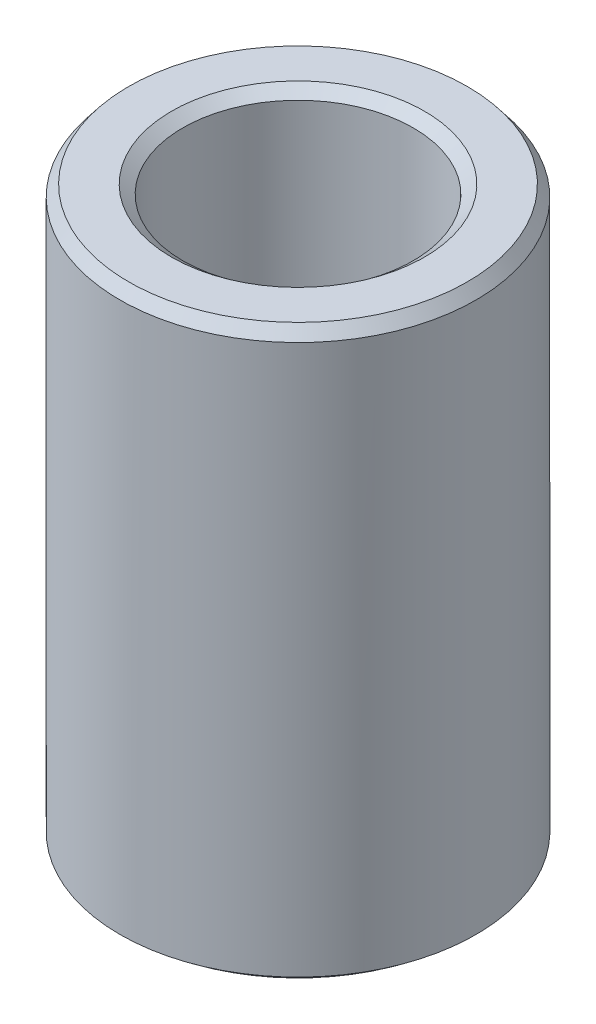
ISO-10303-21;
HEADER;
FILE_DESCRIPTION(('STEP AP214'),'2;1');
FILE_NAME('part.step','',(''),(''),'','','');
FILE_SCHEMA(('AUTOMOTIVE_DESIGN { 1 0 10303 214 1 1 1 1 }'));
ENDSEC;
DATA;
#1=APPLICATION_CONTEXT('core data for automotive mechanical design processes');
#2=APPLICATION_PROTOCOL_DEFINITION('international standard','automotive_design',2000,#1);
#3=PRODUCT_CONTEXT('',#1,'mechanical');
#4=PRODUCT('Part','Part','',(#3));
#5=PRODUCT_RELATED_PRODUCT_CATEGORY('part','',(#4));
#6=PRODUCT_DEFINITION_FORMATION('','',#4);
#7=PRODUCT_DEFINITION_CONTEXT('part definition',#1,'design');
#8=PRODUCT_DEFINITION('design','',#6,#7);
#9=PRODUCT_DEFINITION_SHAPE('','',#8);
#10=(LENGTH_UNIT() NAMED_UNIT(*) SI_UNIT(.MILLI.,.METRE.));
#11=(NAMED_UNIT(*) PLANE_ANGLE_UNIT() SI_UNIT($,.RADIAN.));
#12=(NAMED_UNIT(*) SI_UNIT($,.STERADIAN.) SOLID_ANGLE_UNIT());
#13=UNCERTAINTY_MEASURE_WITH_UNIT(LENGTH_MEASURE(1.E-05),#10,'distance_accuracy_value','');
#14=(GEOMETRIC_REPRESENTATION_CONTEXT(3) GLOBAL_UNCERTAINTY_ASSIGNED_CONTEXT((#13)) GLOBAL_UNIT_ASSIGNED_CONTEXT((#10,
#11,#12)) REPRESENTATION_CONTEXT('',''));
#15=CARTESIAN_POINT('',(0.,0.,0.));
#16=DIRECTION('',(0.,0.,1.));
#17=DIRECTION('',(1.,0.,0.));
#18=AXIS2_PLACEMENT_3D('',#15,#16,#17);
#19=CARTESIAN_POINT('',(0.,127.94824433541,0.));
#20=DIRECTION('',(0.,-1.,0.));
#21=DIRECTION('',(0.,0.,-1.));
#22=AXIS2_PLACEMENT_3D('',#19,#20,#21);
#23=CYLINDRICAL_SURFACE('',#22,40.);
#24=CARTESIAN_POINT('',(0.,1.96694809516779,0.));
#25=DIRECTION('',(0.,1.,0.));
#26=DIRECTION('',(0.,0.,1.));
#27=AXIS2_PLACEMENT_3D('',#24,#25,#26);
#28=CIRCLE('',#27,40.);
#29=CARTESIAN_POINT('',(0.,1.96694809516779,40.));
#30=VERTEX_POINT('',#29);
#31=EDGE_CURVE('E10',#30,#30,#28,.T.);
#32=ORIENTED_EDGE('',*,*,#31,.T.);
#33=EDGE_LOOP('',(#32));
#34=FACE_BOUND('',#33,.T.);
#35=CARTESIAN_POINT('',(0.,125.413653518484,0.));
#36=DIRECTION('',(0.,1.,0.));
#37=DIRECTION('',(0.,0.,1.));
#38=AXIS2_PLACEMENT_3D('',#35,#36,#37);
#39=CIRCLE('',#38,40.);
#40=CARTESIAN_POINT('',(0.,125.413653518484,-40.));
#41=VERTEX_POINT('',#40);
#42=EDGE_CURVE('E50',#41,#41,#39,.F.);
#43=ORIENTED_EDGE('',*,*,#42,.T.);
#44=EDGE_LOOP('',(#43));
#45=FACE_BOUND('',#44,.T.);
#46=ADVANCED_FACE('F39',(#34,#45),#23,.T.);
#47=CARTESIAN_POINT('',(0.,127.94824433541,0.));
#48=DIRECTION('',(0.,1.,0.));
#49=DIRECTION('',(0.,0.,1.));
#50=AXIS2_PLACEMENT_3D('',#47,#48,#49);
#51=PLANE('',#50);
#52=CARTESIAN_POINT('',(0.,127.94824433541,0.));
#53=DIRECTION('',(0.,1.,0.));
#54=DIRECTION('',(0.,0.,1.));
#55=AXIS2_PLACEMENT_3D('',#52,#53,#54);
#56=CIRCLE('',#55,28.4098844104214);
#57=CARTESIAN_POINT('',(0.,127.94824433541,28.4098844104214));
#58=VERTEX_POINT('',#57);
#59=EDGE_CURVE('E58',#58,#58,#56,.F.);
#60=ORIENTED_EDGE('',*,*,#59,.T.);
#61=EDGE_LOOP('',(#60));
#62=FACE_BOUND('',#61,.T.);
#63=CARTESIAN_POINT('',(0.,127.94824433541,0.));
#64=DIRECTION('',(0.,1.,0.));
#65=DIRECTION('',(0.,0.,1.));
#66=AXIS2_PLACEMENT_3D('',#63,#64,#65);
#67=CIRCLE('',#66,38.0330519048322);
#68=CARTESIAN_POINT('',(0.,127.94824433541,-38.0330519048323));
#69=VERTEX_POINT('',#68);
#70=EDGE_CURVE('E61',#69,#69,#67,.T.);
#71=ORIENTED_EDGE('',*,*,#70,.T.);
#72=EDGE_LOOP('',(#71));
#73=FACE_BOUND('',#72,.T.);
#74=ADVANCED_FACE('F88',(#62,#73),#51,.T.);
#75=CARTESIAN_POINT('',(0.,0.,0.));
#76=DIRECTION('',(0.,1.,0.));
#77=DIRECTION('',(0.,0.,1.));
#78=AXIS2_PLACEMENT_3D('',#75,#76,#77);
#79=PLANE('',#78);
#80=CARTESIAN_POINT('',(0.,0.,0.));
#81=DIRECTION('',(0.,1.,0.));
#82=DIRECTION('',(0.,0.,1.));
#83=AXIS2_PLACEMENT_3D('',#80,#81,#82);
#84=CIRCLE('',#83,27.8422416886627);
#85=CARTESIAN_POINT('',(0.,0.,-27.8422416886627));
#86=VERTEX_POINT('',#85);
#87=EDGE_CURVE('E51',#86,#86,#84,.T.);
#88=ORIENTED_EDGE('',*,*,#87,.T.);
#89=EDGE_LOOP('',(#88));
#90=FACE_BOUND('',#89,.T.);
#91=CARTESIAN_POINT('',(0.,0.,0.));
#92=DIRECTION('',(0.,1.,0.));
#93=DIRECTION('',(0.,0.,1.));
#94=AXIS2_PLACEMENT_3D('',#91,#92,#93);
#95=CIRCLE('',#94,37.4654091830734);
#96=CARTESIAN_POINT('',(0.,0.,37.4654091830734));
#97=VERTEX_POINT('',#96);
#98=EDGE_CURVE('E54',#97,#97,#95,.F.);
#99=ORIENTED_EDGE('',*,*,#98,.T.);
#100=EDGE_LOOP('',(#99));
#101=FACE_BOUND('',#100,.T.);
#102=ADVANCED_FACE('F83',(#90,#101),#79,.F.);
#103=CARTESIAN_POINT('',(0.,127.94824433541,0.));
#104=DIRECTION('',(0.,-1.,0.));
#105=DIRECTION('',(0.,0.,-1.));
#106=AXIS2_PLACEMENT_3D('',#103,#104,#105);
#107=CYLINDRICAL_SURFACE('',#106,25.8752935934949);
#108=CARTESIAN_POINT('',(0.,125.981296240243,0.));
#109=DIRECTION('',(0.,1.,0.));
#110=DIRECTION('',(0.,0.,1.));
#111=AXIS2_PLACEMENT_3D('',#108,#109,#110);
#112=CIRCLE('',#111,25.8752935934949);
#113=CARTESIAN_POINT('',(0.,125.981296240243,25.8752935934949));
#114=VERTEX_POINT('',#113);
#115=EDGE_CURVE('E67',#114,#114,#112,.T.);
#116=ORIENTED_EDGE('',*,*,#115,.T.);
#117=EDGE_LOOP('',(#116));
#118=FACE_BOUND('',#117,.T.);
#119=CARTESIAN_POINT('',(0.,2.53459081692656,0.));
#120=DIRECTION('',(0.,1.,0.));
#121=DIRECTION('',(0.,0.,1.));
#122=AXIS2_PLACEMENT_3D('',#119,#120,#121);
#123=CIRCLE('',#122,25.8752935934949);
#124=CARTESIAN_POINT('',(0.,2.53459081692656,-25.8752935934949));
#125=VERTEX_POINT('',#124);
#126=EDGE_CURVE('E69',#125,#125,#123,.F.);
#127=ORIENTED_EDGE('',*,*,#126,.T.);
#128=EDGE_LOOP('',(#127));
#129=FACE_BOUND('',#128,.T.);
#130=ADVANCED_FACE('F71',(#118,#129),#107,.F.);
#131=CARTESIAN_POINT('',(0.,125.981296240243,0.));
#132=DIRECTION('',(0.,1.,0.));
#133=DIRECTION('',(0.,0.,1.));
#134=AXIS2_PLACEMENT_3D('',#131,#132,#133);
#135=CONICAL_SURFACE('',#134,25.8752935934949,0.910835795896197);
#136=ORIENTED_EDGE('',*,*,#59,.F.);
#137=EDGE_LOOP('',(#136));
#138=FACE_BOUND('',#137,.T.);
#139=ORIENTED_EDGE('',*,*,#115,.F.);
#140=EDGE_LOOP('',(#139));
#141=FACE_BOUND('',#140,.T.);
#142=ADVANCED_FACE('F77',(#138,#141),#135,.F.);
#143=CARTESIAN_POINT('',(0.,0.,0.));
#144=DIRECTION('',(0.,-1.,0.));
#145=DIRECTION('',(0.,0.,-1.));
#146=AXIS2_PLACEMENT_3D('',#143,#144,#145);
#147=CONICAL_SURFACE('',#146,27.8422416886627,0.65996053089869);
#148=CARTESIAN_POINT('',(0.,2.53459081692656,-25.8752935934949));
#149=CARTESIAN_POINT('',(0.,2.50818882925024,-25.8957826361529));
#150=CARTESIAN_POINT('',(0.,2.48178684157392,-25.9162716788109));
#151=CARTESIAN_POINT('',(0.,2.42898286622128,-25.9572497641269));
#152=CARTESIAN_POINT('',(0.,2.40258087854497,-25.9777388067849));
#153=CARTESIAN_POINT('',(0.,2.34977690319233,-26.0187168921009));
#154=CARTESIAN_POINT('',(0.,2.32337491551601,-26.0392059347589));
#155=CARTESIAN_POINT('',(0.,2.27057094016337,-26.0801840200749));
#156=CARTESIAN_POINT('',(0.,2.24416895248706,-26.1006730627329));
#157=CARTESIAN_POINT('',(0.,2.19136497713442,-26.1416511480489));
#158=CARTESIAN_POINT('',(0.,2.1649629894581,-26.1621401907069));
#159=CARTESIAN_POINT('',(0.,2.11215901410546,-26.2031182760228));
#160=CARTESIAN_POINT('',(0.,2.08575702642915,-26.2236073186808));
#161=CARTESIAN_POINT('',(0.,2.03295305107651,-26.2645854039968));
#162=CARTESIAN_POINT('',(0.,2.00655106340019,-26.2850744466548));
#163=CARTESIAN_POINT('',(0.,1.95374708804755,-26.3260525319708));
#164=CARTESIAN_POINT('',(0.,1.92734510037124,-26.3465415746288));
#165=CARTESIAN_POINT('',(0.,1.8745411250186,-26.3875196599448));
#166=CARTESIAN_POINT('',(0.,1.84813913734228,-26.4080087026028));
#167=CARTESIAN_POINT('',(0.,1.79533516198964,-26.4489867879188));
#168=CARTESIAN_POINT('',(0.,1.76893317431333,-26.4694758305768));
#169=CARTESIAN_POINT('',(0.,1.71612919896069,-26.5104539158928));
#170=CARTESIAN_POINT('',(0.,1.68972721128437,-26.5309429585508));
#171=CARTESIAN_POINT('',(0.,1.63692323593174,-26.5719210438668));
#172=CARTESIAN_POINT('',(0.,1.61052124825542,-26.5924100865248));
#173=CARTESIAN_POINT('',(0.,1.55771727290278,-26.6333881718408));
#174=CARTESIAN_POINT('',(0.,1.53131528522646,-26.6538772144988));
#175=CARTESIAN_POINT('',(0.,1.47851130987383,-26.6948552998148));
#176=CARTESIAN_POINT('',(0.,1.45210932219751,-26.7153443424728));
#177=CARTESIAN_POINT('',(0.,1.39930534684487,-26.7563224277888));
#178=CARTESIAN_POINT('',(0.,1.37290335916855,-26.7768114704468));
#179=CARTESIAN_POINT('',(0.,1.32009938381591,-26.8177895557628));
#180=CARTESIAN_POINT('',(0.,1.2936973961396,-26.8382785984208));
#181=CARTESIAN_POINT('',(0.,1.24089342078696,-26.8792566837368));
#182=CARTESIAN_POINT('',(0.,1.21449143311064,-26.8997457263948));
#183=CARTESIAN_POINT('',(0.,1.16168745775801,-26.9407238117108));
#184=CARTESIAN_POINT('',(0.,1.13528547008169,-26.9612128543688));
#185=CARTESIAN_POINT('',(0.,1.08248149472905,-27.0021909396848));
#186=CARTESIAN_POINT('',(0.,1.05607950705273,-27.0226799823428));
#187=CARTESIAN_POINT('',(0.,1.0032755317001,-27.0636580676588));
#188=CARTESIAN_POINT('',(0.,0.976873544023777,-27.0841471103168));
#189=CARTESIAN_POINT('',(0.,0.924069568671141,-27.1251251956328));
#190=CARTESIAN_POINT('',(0.,0.897667580994822,-27.1456142382908));
#191=CARTESIAN_POINT('',(0.,0.844863605642185,-27.1865923236067));
#192=CARTESIAN_POINT('',(0.,0.818461617965867,-27.2070813662647));
#193=CARTESIAN_POINT('',(0.,0.765657642613231,-27.2480594515807));
#194=CARTESIAN_POINT('',(0.,0.739255654936913,-27.2685484942387));
#195=CARTESIAN_POINT('',(0.,0.686451679584276,-27.3095265795547));
#196=CARTESIAN_POINT('',(0.,0.660049691907957,-27.3300156222127));
#197=CARTESIAN_POINT('',(0.,0.607245716555321,-27.3709937075287));
#198=CARTESIAN_POINT('',(0.,0.580843728879003,-27.3914827501867));
#199=CARTESIAN_POINT('',(0.,0.528039753526366,-27.4324608355027));
#200=CARTESIAN_POINT('',(0.,0.501637765850048,-27.4529498781607));
#201=CARTESIAN_POINT('',(0.,0.448833790497411,-27.4939279634767));
#202=CARTESIAN_POINT('',(0.,0.422431802821093,-27.5144170061347));
#203=CARTESIAN_POINT('',(0.,0.369627827468456,-27.5553950914507));
#204=CARTESIAN_POINT('',(0.,0.343225839792138,-27.5758841341087));
#205=CARTESIAN_POINT('',(0.,0.290421864439501,-27.6168622194247));
#206=CARTESIAN_POINT('',(0.,0.264019876763183,-27.6373512620827));
#207=CARTESIAN_POINT('',(0.,0.211215901410547,-27.6783293473987));
#208=CARTESIAN_POINT('',(0.,0.184813913734228,-27.6988183900567));
#209=CARTESIAN_POINT('',(0.,0.132009938381592,-27.7397964753727));
#210=CARTESIAN_POINT('',(0.,0.105607950705273,-27.7602855180307));
#211=CARTESIAN_POINT('',(0.,0.052803975352636,-27.8012636033467));
#212=CARTESIAN_POINT('',(0.,0.0264019876763175,-27.8217526460047));
#213=CARTESIAN_POINT('',(0.,0.,-27.8422416886627));
#214=B_SPLINE_CURVE_WITH_KNOTS('',3,(#148,#149,#150,#151,#152,#153,#154,#155,#156,#157,#158,
#159,#160,#161,#162,#163,#164,#165,#166,#167,#168,#169,#170,#171,#172,#173,#174,#175,#176,#177,
#178,#179,#180,#181,#182,#183,#184,#185,#186,#187,#188,#189,#190,#191,#192,#193,#194,#195,#196,
#197,#198,#199,#200,#201,#202,#203,#204,#205,#206,#207,#208,#209,#210,#211,#212,#213),
.UNSPECIFIED.,.F.,.F.,(4,2,2,2,2,2,2,2,2,2,2,2,2,2,2,2,2,2,2,2,2,2,2,2,2,2,2,2,2,2,2,2,4),(0.,
0.100258627562498,0.200517255124994,0.300775882687492,0.401034510249989,0.501293137812485,
0.601551765374983,0.701810392937481,0.802069020499979,0.902327648062474,1.00258627562497,
1.10284490318747,1.20310353074997,1.30336215831246,1.40362078587496,1.50387941343746,
1.60413804099995,1.70439666856245,1.80465529612495,1.90491392368745,2.00517255124994,
2.10543117881244,2.20568980637494,2.30594843393744,2.40620706149993,2.50646568906243,
2.60672431662493,2.70698294418742,2.80724157174992,2.90750019931242,3.00775882687492,
3.10801745443741,3.20827608199991),.UNSPECIFIED.);
#215=EDGE_CURVE('BSEAM73',#125,#86,#214,.T.);
#216=ORIENTED_EDGE('',*,*,#126,.F.);
#217=ORIENTED_EDGE('',*,*,#87,.F.);
#218=ORIENTED_EDGE('',*,*,#215,.T.);
#219=ORIENTED_EDGE('',*,*,#215,.F.);
#220=EDGE_LOOP('',(#216,#218,#217,#219));
#221=FACE_BOUND('',#220,.T.);
#222=ADVANCED_FACE('F73',(#221),#147,.F.);
#223=CARTESIAN_POINT('',(0.,1.96694809516779,0.));
#224=DIRECTION('',(0.,1.,0.));
#225=DIRECTION('',(0.,0.,1.));
#226=AXIS2_PLACEMENT_3D('',#223,#224,#225);
#227=CONICAL_SURFACE('',#226,40.,0.910835795896213);
#228=ORIENTED_EDGE('',*,*,#98,.F.);
#229=EDGE_LOOP('',(#228));
#230=FACE_BOUND('',#229,.T.);
#231=ORIENTED_EDGE('',*,*,#31,.F.);
#232=EDGE_LOOP('',(#231));
#233=FACE_BOUND('',#232,.T.);
#234=ADVANCED_FACE('F76',(#230,#233),#227,.T.);
#235=CARTESIAN_POINT('',(0.,127.94824433541,0.));
#236=DIRECTION('',(0.,-1.,0.));
#237=DIRECTION('',(0.,0.,-1.));
#238=AXIS2_PLACEMENT_3D('',#235,#236,#237);
#239=CONICAL_SURFACE('',#238,38.0330519048322,0.659960530898693);
#240=CARTESIAN_POINT('',(0.,125.413653518484,-40.));
#241=CARTESIAN_POINT('',(0.,125.44005550616,-39.979510957342));
#242=CARTESIAN_POINT('',(0.,125.466457493837,-39.959021914684));
#243=CARTESIAN_POINT('',(0.,125.519261469189,-39.918043829368));
#244=CARTESIAN_POINT('',(0.,125.545663456865,-39.89755478671));
#245=CARTESIAN_POINT('',(0.,125.598467432218,-39.856576701394));
#246=CARTESIAN_POINT('',(0.,125.624869419894,-39.836087658736));
#247=CARTESIAN_POINT('',(0.,125.677673395247,-39.79510957342));
#248=CARTESIAN_POINT('',(0.,125.704075382923,-39.774620530762));
#249=CARTESIAN_POINT('',(0.,125.756879358276,-39.733642445446));
#250=CARTESIAN_POINT('',(0.,125.783281345952,-39.713153402788));
#251=CARTESIAN_POINT('',(0.,125.836085321305,-39.6721753174721));
#252=CARTESIAN_POINT('',(0.,125.862487308981,-39.6516862748141));
#253=CARTESIAN_POINT('',(0.,125.915291284334,-39.6107081894981));
#254=CARTESIAN_POINT('',(0.,125.94169327201,-39.5902191468401));
#255=CARTESIAN_POINT('',(0.,125.994497247363,-39.5492410615241));
#256=CARTESIAN_POINT('',(0.,126.020899235039,-39.5287520188661));
#257=CARTESIAN_POINT('',(0.,126.073703210392,-39.4877739335501));
#258=CARTESIAN_POINT('',(0.,126.100105198068,-39.4672848908921));
#259=CARTESIAN_POINT('',(0.,126.152909173421,-39.4263068055761));
#260=CARTESIAN_POINT('',(0.,126.179311161097,-39.4058177629181));
#261=CARTESIAN_POINT('',(0.,126.23211513645,-39.3648396776021));
#262=CARTESIAN_POINT('',(0.,126.258517124126,-39.3443506349441));
#263=CARTESIAN_POINT('',(0.,126.311321099479,-39.3033725496281));
#264=CARTESIAN_POINT('',(0.,126.337723087155,-39.2828835069701));
#265=CARTESIAN_POINT('',(0.,126.390527062508,-39.2419054216541));
#266=CARTESIAN_POINT('',(0.,126.416929050184,-39.2214163789961));
#267=CARTESIAN_POINT('',(0.,126.469733025537,-39.1804382936801));
#268=CARTESIAN_POINT('',(0.,126.496135013213,-39.1599492510221));
#269=CARTESIAN_POINT('',(0.,126.548938988566,-39.1189711657061));
#270=CARTESIAN_POINT('',(0.,126.575340976242,-39.0984821230481));
#271=CARTESIAN_POINT('',(0.,126.628144951594,-39.0575040377321));
#272=CARTESIAN_POINT('',(0.,126.654546939271,-39.0370149950741));
#273=CARTESIAN_POINT('',(0.,126.707350914623,-38.9960369097581));
#274=CARTESIAN_POINT('',(0.,126.7337529023,-38.9755478671001));
#275=CARTESIAN_POINT('',(0.,126.786556877652,-38.9345697817842));
#276=CARTESIAN_POINT('',(0.,126.812958865329,-38.9140807391262));
#277=CARTESIAN_POINT('',(0.,126.865762840681,-38.8731026538102));
#278=CARTESIAN_POINT('',(0.,126.892164828358,-38.8526136111522));
#279=CARTESIAN_POINT('',(0.,126.94496880371,-38.8116355258362));
#280=CARTESIAN_POINT('',(0.,126.971370791387,-38.7911464831782));
#281=CARTESIAN_POINT('',(0.,127.024174766739,-38.7501683978622));
#282=CARTESIAN_POINT('',(0.,127.050576754416,-38.7296793552042));
#283=CARTESIAN_POINT('',(0.,127.103380729768,-38.6887012698882));
#284=CARTESIAN_POINT('',(0.,127.129782717445,-38.6682122272302));
#285=CARTESIAN_POINT('',(0.,127.182586692797,-38.6272341419142));
#286=CARTESIAN_POINT('',(0.,127.208988680473,-38.6067450992562));
#287=CARTESIAN_POINT('',(0.,127.261792655826,-38.5657670139402));
#288=CARTESIAN_POINT('',(0.,127.288194643502,-38.5452779712822));
#289=CARTESIAN_POINT('',(0.,127.340998618855,-38.5042998859662));
#290=CARTESIAN_POINT('',(0.,127.367400606531,-38.4838108433082));
#291=CARTESIAN_POINT('',(0.,127.420204581884,-38.4428327579922));
#292=CARTESIAN_POINT('',(0.,127.44660656956,-38.4223437153342));
#293=CARTESIAN_POINT('',(0.,127.499410544913,-38.3813656300182));
#294=CARTESIAN_POINT('',(0.,127.525812532589,-38.3608765873602));
#295=CARTESIAN_POINT('',(0.,127.578616507942,-38.3198985020442));
#296=CARTESIAN_POINT('',(0.,127.605018495618,-38.2994094593862));
#297=CARTESIAN_POINT('',(0.,127.657822470971,-38.2584313740702));
#298=CARTESIAN_POINT('',(0.,127.684224458647,-38.2379423314122));
#299=CARTESIAN_POINT('',(0.,127.737028434,-38.1969642460962));
#300=CARTESIAN_POINT('',(0.,127.763430421676,-38.1764752034382));
#301=CARTESIAN_POINT('',(0.,127.816234397029,-38.1354971181223));
#302=CARTESIAN_POINT('',(0.,127.842636384705,-38.1150080754643));
#303=CARTESIAN_POINT('',(0.,127.895440360058,-38.0740299901482));
#304=CARTESIAN_POINT('',(0.,127.921842347734,-38.0535409474903));
#305=CARTESIAN_POINT('',(0.,127.94824433541,-38.0330519048323));
#306=B_SPLINE_CURVE_WITH_KNOTS('',3,(#240,#241,#242,#243,#244,#245,#246,#247,#248,#249,#250,
#251,#252,#253,#254,#255,#256,#257,#258,#259,#260,#261,#262,#263,#264,#265,#266,#267,#268,#269,
#270,#271,#272,#273,#274,#275,#276,#277,#278,#279,#280,#281,#282,#283,#284,#285,#286,#287,#288,
#289,#290,#291,#292,#293,#294,#295,#296,#297,#298,#299,#300,#301,#302,#303,#304,#305),
.UNSPECIFIED.,.F.,.F.,(4,2,2,2,2,2,2,2,2,2,2,2,2,2,2,2,2,2,2,2,2,2,2,2,2,2,2,2,2,2,2,2,4),(0.,
0.100258627562503,0.200517255125001,0.300775882687504,0.401034510249984,0.501293137812483,
0.601551765374986,0.701810392937462,0.802069020499965,0.902327648062467,1.00258627562494,
1.10284490318745,1.20310353074995,1.30336215831243,1.40362078587493,1.50387941343743,
1.60413804099991,1.70439666856241,1.80465529612491,1.90491392368741,2.00517255124989,
2.10543117881239,2.20568980637489,2.30594843393737,2.40620706149987,2.50646568906237,
2.60672431662485,2.70698294418735,2.80724157174985,2.90750019931233,3.00775882687483,
3.10801745443733,3.20827608199983),.UNSPECIFIED.);
#307=EDGE_CURVE('BSEAM45',#41,#69,#306,.T.);
#308=ORIENTED_EDGE('',*,*,#42,.F.);
#309=ORIENTED_EDGE('',*,*,#70,.F.);
#310=ORIENTED_EDGE('',*,*,#307,.T.);
#311=ORIENTED_EDGE('',*,*,#307,.F.);
#312=EDGE_LOOP('',(#308,#310,#309,#311));
#313=FACE_BOUND('',#312,.T.);
#314=ADVANCED_FACE('F45',(#313),#239,.T.);
#315=CLOSED_SHELL('',(#46,#74,#102,#130,#142,#222,#234,#314));
#316=MANIFOLD_SOLID_BREP('B2',#315);
#317=ADVANCED_BREP_SHAPE_REPRESENTATION('',(#18,#316),#14);
#318=SHAPE_DEFINITION_REPRESENTATION(#9,#317);
ENDSEC;
END-ISO-10303-21;
